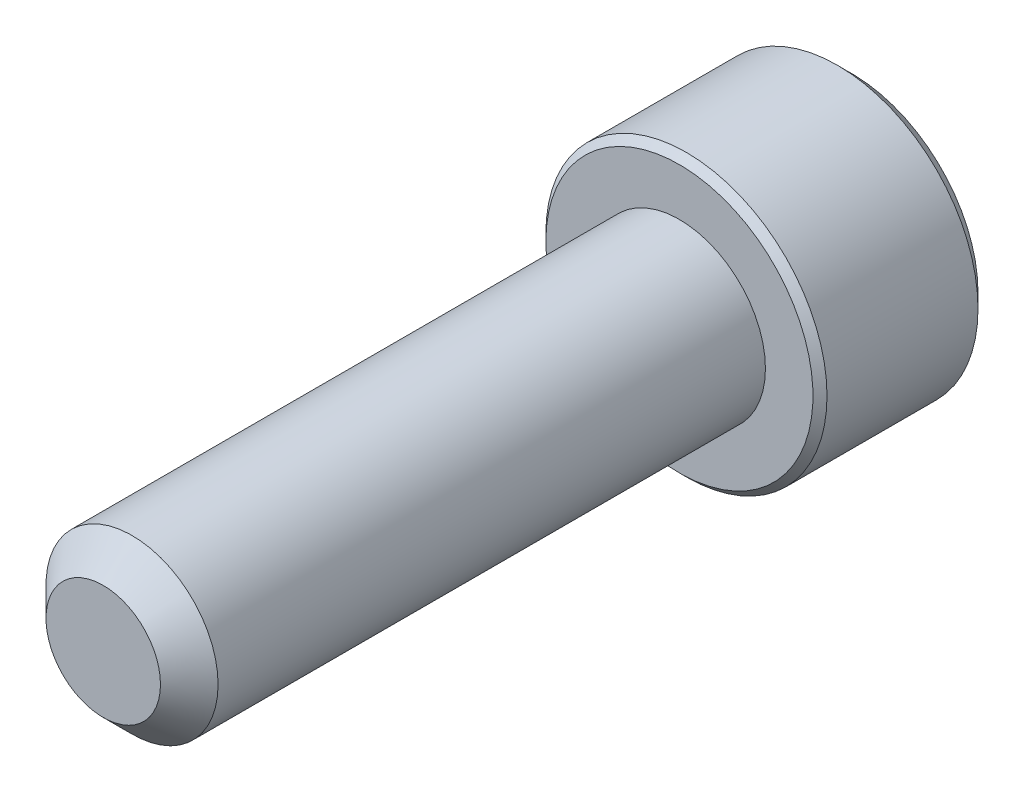
ISO-10303-21;
HEADER;
FILE_DESCRIPTION(('STEP AP214'),'2;1');
FILE_NAME('part.step','',(''),(''),'','','');
FILE_SCHEMA(('AUTOMOTIVE_DESIGN { 1 0 10303 214 1 1 1 1 }'));
ENDSEC;
DATA;
#1=APPLICATION_CONTEXT('core data for automotive mechanical design processes');
#2=APPLICATION_PROTOCOL_DEFINITION('international standard','automotive_design',2000,#1);
#3=PRODUCT_CONTEXT('',#1,'mechanical');
#4=PRODUCT('Part','Part','',(#3));
#5=PRODUCT_RELATED_PRODUCT_CATEGORY('part','',(#4));
#6=PRODUCT_DEFINITION_FORMATION('','',#4);
#7=PRODUCT_DEFINITION_CONTEXT('part definition',#1,'design');
#8=PRODUCT_DEFINITION('design','',#6,#7);
#9=PRODUCT_DEFINITION_SHAPE('','',#8);
#10=(LENGTH_UNIT() NAMED_UNIT(*) SI_UNIT(.MILLI.,.METRE.));
#11=(NAMED_UNIT(*) PLANE_ANGLE_UNIT() SI_UNIT($,.RADIAN.));
#12=(NAMED_UNIT(*) SI_UNIT($,.STERADIAN.) SOLID_ANGLE_UNIT());
#13=UNCERTAINTY_MEASURE_WITH_UNIT(LENGTH_MEASURE(1.E-05),#10,'distance_accuracy_value','');
#14=(GEOMETRIC_REPRESENTATION_CONTEXT(3) GLOBAL_UNCERTAINTY_ASSIGNED_CONTEXT((#13)) GLOBAL_UNIT_ASSIGNED_CONTEXT((#10,
#11,#12)) REPRESENTATION_CONTEXT('',''));
#15=CARTESIAN_POINT('',(0.,0.,0.));
#16=DIRECTION('',(0.,0.,1.));
#17=DIRECTION('',(1.,0.,0.));
#18=AXIS2_PLACEMENT_3D('',#15,#16,#17);
#19=CARTESIAN_POINT('',(0.,0.,-9.525));
#20=DIRECTION('',(0.,0.,1.));
#21=DIRECTION('',(1.,0.,0.));
#22=AXIS2_PLACEMENT_3D('',#19,#20,#21);
#23=CYLINDRICAL_SURFACE('',#22,1.4224);
#24=CARTESIAN_POINT('',(0.,0.,-0.476249999999998));
#25=DIRECTION('',(0.,0.,1.));
#26=DIRECTION('',(1.,0.,0.));
#27=AXIS2_PLACEMENT_3D('',#24,#25,#26);
#28=CIRCLE('',#27,1.4224);
#29=CARTESIAN_POINT('',(1.4224,0.,-0.476249999999998));
#30=VERTEX_POINT('',#29);
#31=EDGE_CURVE('E109',#30,#30,#28,.F.);
#32=CARTESIAN_POINT('',(0.,0.,-9.525));
#33=DIRECTION('',(0.,0.,-1.));
#34=DIRECTION('',(-1.,0.,0.));
#35=AXIS2_PLACEMENT_3D('',#32,#33,#34);
#36=CIRCLE('',#35,1.4224);
#37=CARTESIAN_POINT('',(1.4224,0.,-9.525));
#38=VERTEX_POINT('',#37);
#39=EDGE_CURVE('E209',#38,#38,#36,.F.);
#40=CARTESIAN_POINT('',(1.4224,0.,-0.476249999999998));
#41=CARTESIAN_POINT('',(1.4224,0.,-0.570507812499997));
#42=CARTESIAN_POINT('',(1.4224,0.,-0.664765624999997));
#43=CARTESIAN_POINT('',(1.4224,0.,-0.853281249999997));
#44=CARTESIAN_POINT('',(1.4224,0.,-0.947539062499997));
#45=CARTESIAN_POINT('',(1.4224,0.,-1.1360546875));
#46=CARTESIAN_POINT('',(1.4224,0.,-1.2303125));
#47=CARTESIAN_POINT('',(1.4224,0.,-1.418828125));
#48=CARTESIAN_POINT('',(1.4224,0.,-1.5130859375));
#49=CARTESIAN_POINT('',(1.4224,0.,-1.7016015625));
#50=CARTESIAN_POINT('',(1.4224,0.,-1.795859375));
#51=CARTESIAN_POINT('',(1.4224,0.,-1.984375));
#52=CARTESIAN_POINT('',(1.4224,0.,-2.0786328125));
#53=CARTESIAN_POINT('',(1.4224,0.,-2.2671484375));
#54=CARTESIAN_POINT('',(1.4224,0.,-2.36140625));
#55=CARTESIAN_POINT('',(1.4224,0.,-2.549921875));
#56=CARTESIAN_POINT('',(1.4224,0.,-2.6441796875));
#57=CARTESIAN_POINT('',(1.4224,0.,-2.8326953125));
#58=CARTESIAN_POINT('',(1.4224,0.,-2.926953125));
#59=CARTESIAN_POINT('',(1.4224,0.,-3.11546875));
#60=CARTESIAN_POINT('',(1.4224,0.,-3.2097265625));
#61=CARTESIAN_POINT('',(1.4224,0.,-3.3982421875));
#62=CARTESIAN_POINT('',(1.4224,0.,-3.4925));
#63=CARTESIAN_POINT('',(1.4224,0.,-3.681015625));
#64=CARTESIAN_POINT('',(1.4224,0.,-3.7752734375));
#65=CARTESIAN_POINT('',(1.4224,0.,-3.9637890625));
#66=CARTESIAN_POINT('',(1.4224,0.,-4.058046875));
#67=CARTESIAN_POINT('',(1.4224,0.,-4.2465625));
#68=CARTESIAN_POINT('',(1.4224,0.,-4.3408203125));
#69=CARTESIAN_POINT('',(1.4224,0.,-4.5293359375));
#70=CARTESIAN_POINT('',(1.4224,0.,-4.62359375));
#71=CARTESIAN_POINT('',(1.4224,0.,-4.812109375));
#72=CARTESIAN_POINT('',(1.4224,0.,-4.9063671875));
#73=CARTESIAN_POINT('',(1.4224,0.,-5.0948828125));
#74=CARTESIAN_POINT('',(1.4224,0.,-5.189140625));
#75=CARTESIAN_POINT('',(1.4224,0.,-5.37765625));
#76=CARTESIAN_POINT('',(1.4224,0.,-5.4719140625));
#77=CARTESIAN_POINT('',(1.4224,0.,-5.6604296875));
#78=CARTESIAN_POINT('',(1.4224,0.,-5.7546875));
#79=CARTESIAN_POINT('',(1.4224,0.,-5.943203125));
#80=CARTESIAN_POINT('',(1.4224,0.,-6.0374609375));
#81=CARTESIAN_POINT('',(1.4224,0.,-6.2259765625));
#82=CARTESIAN_POINT('',(1.4224,0.,-6.320234375));
#83=CARTESIAN_POINT('',(1.4224,0.,-6.50875));
#84=CARTESIAN_POINT('',(1.4224,0.,-6.6030078125));
#85=CARTESIAN_POINT('',(1.4224,0.,-6.7915234375));
#86=CARTESIAN_POINT('',(1.4224,0.,-6.88578125));
#87=CARTESIAN_POINT('',(1.4224,0.,-7.074296875));
#88=CARTESIAN_POINT('',(1.4224,0.,-7.1685546875));
#89=CARTESIAN_POINT('',(1.4224,0.,-7.3570703125));
#90=CARTESIAN_POINT('',(1.4224,0.,-7.451328125));
#91=CARTESIAN_POINT('',(1.4224,0.,-7.63984375));
#92=CARTESIAN_POINT('',(1.4224,0.,-7.7341015625));
#93=CARTESIAN_POINT('',(1.4224,0.,-7.9226171875));
#94=CARTESIAN_POINT('',(1.4224,0.,-8.016875));
#95=CARTESIAN_POINT('',(1.4224,0.,-8.205390625));
#96=CARTESIAN_POINT('',(1.4224,0.,-8.2996484375));
#97=CARTESIAN_POINT('',(1.4224,0.,-8.4881640625));
#98=CARTESIAN_POINT('',(1.4224,0.,-8.582421875));
#99=CARTESIAN_POINT('',(1.4224,0.,-8.7709375));
#100=CARTESIAN_POINT('',(1.4224,0.,-8.8651953125));
#101=CARTESIAN_POINT('',(1.4224,0.,-9.0537109375));
#102=CARTESIAN_POINT('',(1.4224,0.,-9.14796875));
#103=CARTESIAN_POINT('',(1.4224,0.,-9.336484375));
#104=CARTESIAN_POINT('',(1.4224,0.,-9.4307421875));
#105=CARTESIAN_POINT('',(1.4224,0.,-9.525));
#106=B_SPLINE_CURVE_WITH_KNOTS('',3,(#40,#41,#42,#43,#44,#45,#46,#47,#48,#49,#50,#51,#52,#53,
#54,#55,#56,#57,#58,#59,#60,#61,#62,#63,#64,#65,#66,#67,#68,#69,#70,#71,#72,#73,#74,#75,#76,#77,
#78,#79,#80,#81,#82,#83,#84,#85,#86,#87,#88,#89,#90,#91,#92,#93,#94,#95,#96,#97,#98,#99,#100,
#101,#102,#103,#104,#105),.UNSPECIFIED.,.F.,.F.,(4,2,2,2,2,2,2,2,2,2,2,2,2,2,2,2,2,2,2,2,2,2,2,
2,2,2,2,2,2,2,2,2,4),(0.,0.2827734375,0.565546875,0.848320312500001,1.13109375,1.4138671875,
1.696640625,1.9794140625,2.2621875,2.5449609375,2.827734375,3.1105078125,3.39328125,
3.6760546875,3.958828125,4.2416015625,4.524375,4.8071484375,5.089921875,5.3726953125,5.65546875,
5.9382421875,6.221015625,6.5037890625,6.7865625,7.0693359375,7.352109375,7.6348828125,
7.91765625,8.2004296875,8.483203125,8.7659765625,9.04875),.UNSPECIFIED.);
#107=EDGE_CURVE('BSEAM35',#30,#38,#106,.T.);
#108=ORIENTED_EDGE('',*,*,#31,.T.);
#109=ORIENTED_EDGE('',*,*,#39,.T.);
#110=ORIENTED_EDGE('',*,*,#107,.T.);
#111=ORIENTED_EDGE('',*,*,#107,.F.);
#112=EDGE_LOOP('',(#108,#110,#109,#111));
#113=FACE_BOUND('',#112,.T.);
#114=ADVANCED_FACE('F35',(#113),#23,.T.);
#115=CARTESIAN_POINT('',(0.,0.,0.));
#116=DIRECTION('',(0.,0.,1.));
#117=DIRECTION('',(1.,0.,0.));
#118=AXIS2_PLACEMENT_3D('',#115,#116,#117);
#119=PLANE('',#118);
#120=CARTESIAN_POINT('',(0.,0.,0.));
#121=DIRECTION('',(0.,0.,1.));
#122=DIRECTION('',(1.,0.,0.));
#123=AXIS2_PLACEMENT_3D('',#120,#121,#122);
#124=CIRCLE('',#123,0.946150000000001);
#125=CARTESIAN_POINT('',(0.946150000000001,0.,0.));
#126=VERTEX_POINT('',#125);
#127=EDGE_CURVE('E208',#126,#126,#124,.T.);
#128=ORIENTED_EDGE('',*,*,#127,.T.);
#129=EDGE_LOOP('',(#128));
#130=FACE_BOUND('',#129,.T.);
#131=ADVANCED_FACE('F186',(#130),#119,.T.);
#132=CARTESIAN_POINT('',(0.,0.,0.));
#133=DIRECTION('',(0.,0.,-1.));
#134=DIRECTION('',(-1.,0.,0.));
#135=AXIS2_PLACEMENT_3D('',#132,#133,#134);
#136=CONICAL_SURFACE('',#135,0.946150000000001,0.78539816339745);
#137=ORIENTED_EDGE('',*,*,#31,.F.);
#138=EDGE_LOOP('',(#137));
#139=FACE_BOUND('',#138,.T.);
#140=ORIENTED_EDGE('',*,*,#127,.F.);
#141=EDGE_LOOP('',(#140));
#142=FACE_BOUND('',#141,.T.);
#143=ADVANCED_FACE('F192',(#139,#142),#136,.T.);
#144=CARTESIAN_POINT('',(0.,0.,-12.3698));
#145=DIRECTION('',(0.,0.,1.));
#146=DIRECTION('',(1.,0.,0.));
#147=AXIS2_PLACEMENT_3D('',#144,#145,#146);
#148=CYLINDRICAL_SURFACE('',#147,2.3241);
#149=CARTESIAN_POINT('',(0.,0.,-9.641205));
#150=DIRECTION('',(0.,0.,-1.));
#151=DIRECTION('',(-1.,0.,0.));
#152=AXIS2_PLACEMENT_3D('',#149,#150,#151);
#153=CIRCLE('',#152,2.3241);
#154=CARTESIAN_POINT('',(2.3241,0.,-9.641205));
#155=VERTEX_POINT('',#154);
#156=EDGE_CURVE('E43',#155,#155,#153,.T.);
#157=CARTESIAN_POINT('',(0.,0.,-12.13739));
#158=DIRECTION('',(0.,0.,-1.));
#159=DIRECTION('',(-1.,0.,0.));
#160=AXIS2_PLACEMENT_3D('',#157,#158,#159);
#161=CIRCLE('',#160,2.3241);
#162=CARTESIAN_POINT('',(2.3241,0.,-12.13739));
#163=VERTEX_POINT('',#162);
#164=EDGE_CURVE('E169',#163,#163,#161,.F.);
#165=CARTESIAN_POINT('',(2.3241,0.,-9.641205));
#166=CARTESIAN_POINT('',(2.3241,0.,-9.66720692708333));
#167=CARTESIAN_POINT('',(2.3241,0.,-9.69320885416667));
#168=CARTESIAN_POINT('',(2.3241,0.,-9.74521270833333));
#169=CARTESIAN_POINT('',(2.3241,0.,-9.77121463541667));
#170=CARTESIAN_POINT('',(2.3241,0.,-9.82321848958333));
#171=CARTESIAN_POINT('',(2.3241,0.,-9.84922041666666));
#172=CARTESIAN_POINT('',(2.3241,0.,-9.90122427083333));
#173=CARTESIAN_POINT('',(2.3241,0.,-9.92722619791667));
#174=CARTESIAN_POINT('',(2.3241,0.,-9.97923005208333));
#175=CARTESIAN_POINT('',(2.3241,0.,-10.0052319791667));
#176=CARTESIAN_POINT('',(2.3241,0.,-10.0572358333333));
#177=CARTESIAN_POINT('',(2.3241,0.,-10.0832377604167));
#178=CARTESIAN_POINT('',(2.3241,0.,-10.1352416145833));
#179=CARTESIAN_POINT('',(2.3241,0.,-10.1612435416667));
#180=CARTESIAN_POINT('',(2.3241,0.,-10.2132473958333));
#181=CARTESIAN_POINT('',(2.3241,0.,-10.2392493229167));
#182=CARTESIAN_POINT('',(2.3241,0.,-10.2912531770833));
#183=CARTESIAN_POINT('',(2.3241,0.,-10.3172551041667));
#184=CARTESIAN_POINT('',(2.3241,0.,-10.3692589583333));
#185=CARTESIAN_POINT('',(2.3241,0.,-10.3952608854167));
#186=CARTESIAN_POINT('',(2.3241,0.,-10.4472647395833));
#187=CARTESIAN_POINT('',(2.3241,0.,-10.4732666666667));
#188=CARTESIAN_POINT('',(2.3241,0.,-10.5252705208333));
#189=CARTESIAN_POINT('',(2.3241,0.,-10.5512724479167));
#190=CARTESIAN_POINT('',(2.3241,0.,-10.6032763020833));
#191=CARTESIAN_POINT('',(2.3241,0.,-10.6292782291667));
#192=CARTESIAN_POINT('',(2.3241,0.,-10.6812820833333));
#193=CARTESIAN_POINT('',(2.3241,0.,-10.7072840104167));
#194=CARTESIAN_POINT('',(2.3241,0.,-10.7592878645833));
#195=CARTESIAN_POINT('',(2.3241,0.,-10.7852897916667));
#196=CARTESIAN_POINT('',(2.3241,0.,-10.8372936458333));
#197=CARTESIAN_POINT('',(2.3241,0.,-10.8632955729167));
#198=CARTESIAN_POINT('',(2.3241,0.,-10.9152994270833));
#199=CARTESIAN_POINT('',(2.3241,0.,-10.9413013541667));
#200=CARTESIAN_POINT('',(2.3241,0.,-10.9933052083333));
#201=CARTESIAN_POINT('',(2.3241,0.,-11.0193071354167));
#202=CARTESIAN_POINT('',(2.3241,0.,-11.0713109895833));
#203=CARTESIAN_POINT('',(2.3241,0.,-11.0973129166667));
#204=CARTESIAN_POINT('',(2.3241,0.,-11.1493167708333));
#205=CARTESIAN_POINT('',(2.3241,0.,-11.1753186979167));
#206=CARTESIAN_POINT('',(2.3241,0.,-11.2273225520833));
#207=CARTESIAN_POINT('',(2.3241,0.,-11.2533244791667));
#208=CARTESIAN_POINT('',(2.3241,0.,-11.3053283333333));
#209=CARTESIAN_POINT('',(2.3241,0.,-11.3313302604167));
#210=CARTESIAN_POINT('',(2.3241,0.,-11.3833341145833));
#211=CARTESIAN_POINT('',(2.3241,0.,-11.4093360416667));
#212=CARTESIAN_POINT('',(2.3241,0.,-11.4613398958333));
#213=CARTESIAN_POINT('',(2.3241,0.,-11.4873418229167));
#214=CARTESIAN_POINT('',(2.3241,0.,-11.5393456770833));
#215=CARTESIAN_POINT('',(2.3241,0.,-11.5653476041667));
#216=CARTESIAN_POINT('',(2.3241,0.,-11.6173514583333));
#217=CARTESIAN_POINT('',(2.3241,0.,-11.6433533854167));
#218=CARTESIAN_POINT('',(2.3241,0.,-11.6953572395833));
#219=CARTESIAN_POINT('',(2.3241,0.,-11.7213591666667));
#220=CARTESIAN_POINT('',(2.3241,0.,-11.7733630208333));
#221=CARTESIAN_POINT('',(2.3241,0.,-11.7993649479167));
#222=CARTESIAN_POINT('',(2.3241,0.,-11.8513688020833));
#223=CARTESIAN_POINT('',(2.3241,0.,-11.8773707291667));
#224=CARTESIAN_POINT('',(2.3241,0.,-11.9293745833333));
#225=CARTESIAN_POINT('',(2.3241,0.,-11.9553765104167));
#226=CARTESIAN_POINT('',(2.3241,0.,-12.0073803645833));
#227=CARTESIAN_POINT('',(2.3241,0.,-12.0333822916667));
#228=CARTESIAN_POINT('',(2.3241,0.,-12.0853861458333));
#229=CARTESIAN_POINT('',(2.3241,0.,-12.1113880729167));
#230=CARTESIAN_POINT('',(2.3241,0.,-12.13739));
#231=B_SPLINE_CURVE_WITH_KNOTS('',3,(#165,#166,#167,#168,#169,#170,#171,#172,#173,#174,#175,
#176,#177,#178,#179,#180,#181,#182,#183,#184,#185,#186,#187,#188,#189,#190,#191,#192,#193,#194,
#195,#196,#197,#198,#199,#200,#201,#202,#203,#204,#205,#206,#207,#208,#209,#210,#211,#212,#213,
#214,#215,#216,#217,#218,#219,#220,#221,#222,#223,#224,#225,#226,#227,#228,#229,#230),
.UNSPECIFIED.,.F.,.F.,(4,2,2,2,2,2,2,2,2,2,2,2,2,2,2,2,2,2,2,2,2,2,2,2,2,2,2,2,2,2,2,2,4),(0.,
0.0780057812499995,0.156011562499999,0.234017343749998,0.312023124999998,0.390028906249999,
0.468034687499999,0.546040468749998,0.624046249999998,0.702052031249997,0.780057812499999,
0.858063593749998,0.936069374999998,1.01407515625,1.0920809375,1.17008671875,1.2480925,
1.32609828125,1.4041040625,1.48210984375,1.560115625,1.63812140625,1.7161271875,1.79413296875,
1.87213875,1.95014453125,2.0281503125,2.10615609375,2.184161875,2.26216765625,2.3401734375,
2.41817921874999,2.49618499999999),.UNSPECIFIED.);
#232=EDGE_CURVE('BSEAM174',#155,#163,#231,.T.);
#233=ORIENTED_EDGE('',*,*,#156,.T.);
#234=ORIENTED_EDGE('',*,*,#164,.T.);
#235=ORIENTED_EDGE('',*,*,#232,.T.);
#236=ORIENTED_EDGE('',*,*,#232,.F.);
#237=EDGE_LOOP('',(#233,#235,#234,#236));
#238=FACE_BOUND('',#237,.T.);
#239=ADVANCED_FACE('F174',(#238),#148,.T.);
#240=CARTESIAN_POINT('',(0.,0.,-12.3698));
#241=DIRECTION('',(0.,0.,-1.));
#242=DIRECTION('',(-1.,0.,0.));
#243=AXIS2_PLACEMENT_3D('',#240,#241,#242);
#244=PLANE('',#243);
#245=CARTESIAN_POINT('',(0.,0.,-12.3698));
#246=DIRECTION('',(0.,0.,-1.));
#247=DIRECTION('',(-1.,0.,0.));
#248=AXIS2_PLACEMENT_3D('',#245,#246,#247);
#249=CIRCLE('',#248,2.09169);
#250=CARTESIAN_POINT('',(2.09169,0.,-12.3698));
#251=VERTEX_POINT('',#250);
#252=EDGE_CURVE('E108',#251,#251,#249,.T.);
#253=ORIENTED_EDGE('',*,*,#252,.T.);
#254=EDGE_LOOP('',(#253));
#255=FACE_BOUND('',#254,.T.);
#256=CARTESIAN_POINT('',(0.,0.,-12.3698));
#257=DIRECTION('',(0.,0.,-1.));
#258=DIRECTION('',(-1.,0.,0.));
#259=AXIS2_PLACEMENT_3D('',#256,#257,#258);
#260=CIRCLE('',#259,1.3748153285078);
#261=CARTESIAN_POINT('',(-1.190625,0.687407664253897,-12.3698));
#262=VERTEX_POINT('',#261);
#263=CARTESIAN_POINT('',(0.,1.3748153285078,-12.3698));
#264=VERTEX_POINT('',#263);
#265=EDGE_CURVE('E89',#262,#264,#260,.T.);
#266=ORIENTED_EDGE('',*,*,#265,.F.);
#267=CARTESIAN_POINT('',(-1.190625,-0.687407664253898,-12.3698));
#268=VERTEX_POINT('',#267);
#269=EDGE_CURVE('E49',#268,#262,#260,.T.);
#270=ORIENTED_EDGE('',*,*,#269,.F.);
#271=CARTESIAN_POINT('',(0.,-1.3748153285078,-12.3698));
#272=VERTEX_POINT('',#271);
#273=EDGE_CURVE('E265',#272,#268,#260,.T.);
#274=ORIENTED_EDGE('',*,*,#273,.F.);
#275=CARTESIAN_POINT('',(1.190625,-0.687407664253898,-12.3698));
#276=VERTEX_POINT('',#275);
#277=EDGE_CURVE('E56',#276,#272,#260,.T.);
#278=ORIENTED_EDGE('',*,*,#277,.F.);
#279=CARTESIAN_POINT('',(1.190625,0.687407664253899,-12.3698));
#280=VERTEX_POINT('',#279);
#281=EDGE_CURVE('E130',#280,#276,#260,.T.);
#282=ORIENTED_EDGE('',*,*,#281,.F.);
#283=EDGE_CURVE('E98',#264,#280,#260,.T.);
#284=ORIENTED_EDGE('',*,*,#283,.F.);
#285=EDGE_LOOP('',(#266,#270,#274,#278,#282,#284));
#286=FACE_BOUND('',#285,.T.);
#287=ADVANCED_FACE('F129',(#255,#286),#244,.T.);
#288=CARTESIAN_POINT('',(0.,0.,-9.525));
#289=DIRECTION('',(0.,0.,-1.));
#290=DIRECTION('',(-1.,0.,0.));
#291=AXIS2_PLACEMENT_3D('',#288,#289,#290);
#292=PLANE('',#291);
#293=CARTESIAN_POINT('',(0.,0.,-9.525));
#294=DIRECTION('',(0.,0.,-1.));
#295=DIRECTION('',(-1.,0.,0.));
#296=AXIS2_PLACEMENT_3D('',#293,#294,#295);
#297=CIRCLE('',#296,2.207895);
#298=CARTESIAN_POINT('',(-2.207895,0.,-9.525));
#299=VERTEX_POINT('',#298);
#300=EDGE_CURVE('E11',#299,#299,#297,.F.);
#301=ORIENTED_EDGE('',*,*,#300,.T.);
#302=EDGE_LOOP('',(#301));
#303=FACE_BOUND('',#302,.T.);
#304=ORIENTED_EDGE('',*,*,#39,.F.);
#305=EDGE_LOOP('',(#304));
#306=FACE_BOUND('',#305,.T.);
#307=ADVANCED_FACE('F277',(#303,#306),#292,.F.);
#308=CARTESIAN_POINT('',(0.,0.,-12.3698));
#309=DIRECTION('',(0.,0.,-1.));
#310=DIRECTION('',(-1.,0.,0.));
#311=AXIS2_PLACEMENT_3D('',#308,#309,#310);
#312=CONICAL_SURFACE('',#311,1.3748153285078,0.78539816339745);
#313=ORIENTED_EDGE('',*,*,#283,.T.);
#314=CARTESIAN_POINT('',(-0.00020000000000008,1.37493079856163,-12.3699154846));
#315=CARTESIAN_POINT('',(0.0407344195898564,1.35129730039231,-12.3462987642143));
#316=CARTESIAN_POINT('',(0.082353388301974,1.32726857760297,-12.3240687817231));
#317=CARTESIAN_POINT('',(0.167219443673632,1.27827113768908,-12.2833656626274));
#318=CARTESIAN_POINT('',(0.21047460729096,1.25329775733078,-12.2649151826476));
#319=CARTESIAN_POINT('',(0.297696647457423,1.2029400889614,-12.2333088380043));
#320=CARTESIAN_POINT('',(0.341641294957924,1.17756863489755,-12.2200735042433));
#321=CARTESIAN_POINT('',(0.430498374163693,1.12626697629869,-12.1996814515754));
#322=CARTESIAN_POINT('',(0.475408088834754,1.10033834044413,-12.192509502896));
#323=CARTESIAN_POINT('',(0.552804127656977,1.0556537165959,-12.1860385386489));
#324=CARTESIAN_POINT('',(0.585190412515645,1.0369554863147,-12.1850803201468));
#325=CARTESIAN_POINT('',(0.649906073317768,0.99959188212981,-12.1866926490721));
#326=CARTESIAN_POINT('',(0.682235435127271,0.980926516386365,-12.1892639751796));
#327=CARTESIAN_POINT('',(0.746582156071483,0.943775919727755,-12.1977867539936));
#328=CARTESIAN_POINT('',(0.778599196336766,0.925290872911938,-12.2037413547526));
#329=CARTESIAN_POINT('',(0.842098763396455,0.888629380776602,-12.2187099640712));
#330=CARTESIAN_POINT('',(0.873581054644162,0.870453071450032,-12.2277252859121));
#331=CARTESIAN_POINT('',(0.954214838572126,0.823899134593445,-12.254482295838));
#332=CARTESIAN_POINT('',(1.00285783526766,0.795815087357089,-12.274236814436));
#333=CARTESIAN_POINT('',(1.09823941635212,0.740746505842243,-12.3187367689577));
#334=CARTESIAN_POINT('',(1.14498361758716,0.713758728676141,-12.3434659647162));
#335=CARTESIAN_POINT('',(1.190825,0.68729219420006,-12.3699154846));
#336=B_SPLINE_CURVE_WITH_KNOTS('',3,(#314,#315,#316,#317,#318,#319,#320,#321,#322,#323,#324,
#325,#326,#327,#328,#329,#330,#331,#332,#333,#334,#335),.UNSPECIFIED.,.F.,.F.,(4,2,2,2,2,2,2,2,
2,2,4),(0.,0.158625672934121,0.318176079843271,0.475191357500655,0.631811068630747,
0.743878551794716,0.855970763007027,0.968167444423239,1.08041232768376,1.25873351645467,
1.43648174479847),.UNSPECIFIED.);
#337=EDGE_CURVE('E103',#264,#280,#336,.T.);
#338=ORIENTED_EDGE('',*,*,#337,.F.);
#339=EDGE_LOOP('',(#313,#338));
#340=FACE_BOUND('',#339,.T.);
#341=ADVANCED_FACE('F104',(#340),#312,.F.);
#342=ORIENTED_EDGE('',*,*,#281,.T.);
#343=CARTESIAN_POINT('',(1.190625,-1.37097145294694,-12.8107904472899));
#344=CARTESIAN_POINT('',(1.190625,-1.3375892063789,-12.7855899888078));
#345=CARTESIAN_POINT('',(1.190625,-1.30402095496658,-12.7606366202375));
#346=CARTESIAN_POINT('',(1.190625,-1.23643692297761,-12.7113260871772));
#347=CARTESIAN_POINT('',(1.190625,-1.20242103219112,-12.6869690738994));
#348=CARTESIAN_POINT('',(1.190625,-1.09909081482554,-12.6145982089892));
#349=CARTESIAN_POINT('',(1.190625,-1.02900143506767,-12.5676726225956));
#350=CARTESIAN_POINT('',(1.190625,-0.88202673742423,-12.4755521033256));
#351=CARTESIAN_POINT('',(1.190625,-0.804981866019981,-12.4306088372421));
#352=CARTESIAN_POINT('',(1.190625,-0.647043893307965,-12.3483980245069));
#353=CARTESIAN_POINT('',(1.190625,-0.566164943702921,-12.3111046017321));
#354=CARTESIAN_POINT('',(1.190625,-0.444764933868856,-12.2654795555631));
#355=CARTESIAN_POINT('',(1.190625,-0.406041211486713,-12.2523848390215));
#356=CARTESIAN_POINT('',(1.190625,-0.327658904711933,-12.2293042758966));
#357=CARTESIAN_POINT('',(1.190625,-0.288000256118252,-12.219318643486));
#358=CARTESIAN_POINT('',(1.190625,-0.208647693212097,-12.2031412290653));
#359=CARTESIAN_POINT('',(1.190625,-0.168967240621962,-12.196884445849));
#360=CARTESIAN_POINT('',(1.190625,-0.0891819742965338,-12.1882868884185));
#361=CARTESIAN_POINT('',(1.190625,-0.0490772347013131,-12.1859454410499));
#362=CARTESIAN_POINT('',(1.190625,0.0297075773931757,-12.1853522440677));
#363=CARTESIAN_POINT('',(1.190625,0.0683866068288079,-12.1869553537961));
#364=CARTESIAN_POINT('',(1.190625,0.14541687663315,-12.1938430277445));
#365=CARTESIAN_POINT('',(1.190625,0.183768052740678,-12.1991282976685));
#366=CARTESIAN_POINT('',(1.190625,0.260508634904943,-12.2131814122329));
#367=CARTESIAN_POINT('',(1.190625,0.298887052039132,-12.2220083626058));
#368=CARTESIAN_POINT('',(1.190625,0.374805334250663,-12.2426757099806));
#369=CARTESIAN_POINT('',(1.190625,0.412345269207093,-12.2545158548359));
#370=CARTESIAN_POINT('',(1.190625,0.530535580908839,-12.2962473336672));
#371=CARTESIAN_POINT('',(1.190625,0.609503725744446,-12.3308913969143));
#372=CARTESIAN_POINT('',(1.190625,0.763730269113466,-12.4079182519749));
#373=CARTESIAN_POINT('',(1.190625,0.838974064674606,-12.4503288466687));
#374=CARTESIAN_POINT('',(1.190625,0.982775796189617,-12.537825645025));
#375=CARTESIAN_POINT('',(1.190625,1.05148016607044,-12.5826741620552));
#376=CARTESIAN_POINT('',(1.190625,1.15270222256253,-12.6520053299226));
#377=CARTESIAN_POINT('',(1.190625,1.18600604145834,-12.6753601763372));
#378=CARTESIAN_POINT('',(1.190625,1.25215860362231,-12.7226875690193));
#379=CARTESIAN_POINT('',(1.190625,1.28500746868278,-12.7466599448583));
#380=CARTESIAN_POINT('',(1.190625,1.31766689427973,-12.7708883667713));
#381=B_SPLINE_CURVE_WITH_KNOTS('',3,(#343,#344,#345,#346,#347,#348,#349,#350,#351,#352,#353,
#354,#355,#356,#357,#358,#359,#360,#361,#362,#363,#364,#365,#366,#367,#368,#369,#370,#371,#372,
#373,#374,#375,#376,#377,#378,#379,#380),.UNSPECIFIED.,.F.,.F.,(4,2,2,2,2,2,2,2,2,2,2,2,2,2,2,2,
2,2,4),(0.,0.12547564476333,0.250982782413966,0.503912518769173,0.771279184643223,
1.03772598255657,1.16025581644629,1.28279408906665,1.40312855503246,1.5234423300503,
1.63939577664877,1.75537145240477,1.87336894094838,1.99135655861152,2.24929724983449,
2.50818004711563,2.75419821472196,2.87622362118596,2.99821570388961),.UNSPECIFIED.);
#382=EDGE_CURVE('E97',#280,#276,#381,.F.);
#383=ORIENTED_EDGE('',*,*,#382,.F.);
#384=EDGE_LOOP('',(#342,#383));
#385=FACE_BOUND('',#384,.T.);
#386=ADVANCED_FACE('F271',(#385),#312,.F.);
#387=ORIENTED_EDGE('',*,*,#277,.T.);
#388=CARTESIAN_POINT('',(1.190825,-0.687292194200061,-12.3699154846));
#389=CARTESIAN_POINT('',(1.14989058041014,-0.710925692369386,-12.3462987642143));
#390=CARTESIAN_POINT('',(1.10827161169803,-0.734954415158721,-12.3240687817231));
#391=CARTESIAN_POINT('',(1.02340555632637,-0.78395185507261,-12.2833656626274));
#392=CARTESIAN_POINT('',(0.98015039270904,-0.808925235430916,-12.2649151826476));
#393=CARTESIAN_POINT('',(0.892928352542576,-0.859282903800292,-12.2333088380043));
#394=CARTESIAN_POINT('',(0.848983705042075,-0.884654357864149,-12.2200735042433));
#395=CARTESIAN_POINT('',(0.760126625836307,-0.935956016463003,-12.1996814515754));
#396=CARTESIAN_POINT('',(0.715216911165246,-0.96188465231757,-12.192509502896));
#397=CARTESIAN_POINT('',(0.637820872343022,-1.00656927616579,-12.1860385386489));
#398=CARTESIAN_POINT('',(0.605434587484354,-1.025267506447,-12.1850803201468));
#399=CARTESIAN_POINT('',(0.540718926682231,-1.06263111063189,-12.1866926490721));
#400=CARTESIAN_POINT('',(0.508389564872728,-1.08129647637533,-12.1892639751796));
#401=CARTESIAN_POINT('',(0.444042843928516,-1.11844707303394,-12.1977867539936));
#402=CARTESIAN_POINT('',(0.412025803663233,-1.13693211984976,-12.2037413547526));
#403=CARTESIAN_POINT('',(0.348526236603543,-1.17359361198509,-12.2187099640712));
#404=CARTESIAN_POINT('',(0.317043945355836,-1.19176992131166,-12.2277252859121));
#405=CARTESIAN_POINT('',(0.236410161427874,-1.23832385816825,-12.254482295838));
#406=CARTESIAN_POINT('',(0.187767164732342,-1.26640790540461,-12.274236814436));
#407=CARTESIAN_POINT('',(0.0923855836478811,-1.32147648691945,-12.3187367689577));
#408=CARTESIAN_POINT('',(0.0456413824128445,-1.34846426408555,-12.3434659647162));
#409=CARTESIAN_POINT('',(-0.000199999999999968,-1.37493079856163,-12.3699154846));
#410=B_SPLINE_CURVE_WITH_KNOTS('',3,(#388,#389,#390,#391,#392,#393,#394,#395,#396,#397,#398,
#399,#400,#401,#402,#403,#404,#405,#406,#407,#408,#409),.UNSPECIFIED.,.F.,.F.,(4,2,2,2,2,2,2,2,
2,2,4),(0.,0.15862567293412,0.318176079843271,0.475191357500655,0.631811068630748,
0.743878551794717,0.855970763007028,0.968167444423241,1.08041232768376,1.25873351645467,
1.43648174479847),.UNSPECIFIED.);
#411=EDGE_CURVE('E139',#276,#272,#410,.T.);
#412=ORIENTED_EDGE('',*,*,#411,.F.);
#413=EDGE_LOOP('',(#387,#412));
#414=FACE_BOUND('',#413,.T.);
#415=ADVANCED_FACE('F268',(#414),#312,.F.);
#416=ORIENTED_EDGE('',*,*,#273,.T.);
#417=CARTESIAN_POINT('',(0.000200000000000319,-1.37493079856163,-12.3699154846));
#418=CARTESIAN_POINT('',(-0.0407344195898558,-1.35129730039231,-12.3462987642143));
#419=CARTESIAN_POINT('',(-0.0823533883019732,-1.32726857760297,-12.3240687817231));
#420=CARTESIAN_POINT('',(-0.167219443673632,-1.27827113768909,-12.2833656626274));
#421=CARTESIAN_POINT('',(-0.21047460729096,-1.25329775733078,-12.2649151826476));
#422=CARTESIAN_POINT('',(-0.297696647457424,-1.2029400889614,-12.2333088380043));
#423=CARTESIAN_POINT('',(-0.341641294957925,-1.17756863489755,-12.2200735042433));
#424=CARTESIAN_POINT('',(-0.430498374163694,-1.12626697629869,-12.1996814515754));
#425=CARTESIAN_POINT('',(-0.475408088834755,-1.10033834044413,-12.192509502896));
#426=CARTESIAN_POINT('',(-0.552804127656979,-1.0556537165959,-12.1860385386489));
#427=CARTESIAN_POINT('',(-0.585190412515647,-1.0369554863147,-12.1850803201468));
#428=CARTESIAN_POINT('',(-0.64990607331777,-0.99959188212981,-12.1866926490721));
#429=CARTESIAN_POINT('',(-0.682235435127273,-0.980926516386364,-12.1892639751796));
#430=CARTESIAN_POINT('',(-0.746582156071485,-0.943775919727754,-12.1977867539936));
#431=CARTESIAN_POINT('',(-0.778599196336769,-0.925290872911937,-12.2037413547526));
#432=CARTESIAN_POINT('',(-0.842098763396458,-0.888629380776601,-12.2187099640712));
#433=CARTESIAN_POINT('',(-0.873581054644165,-0.870453071450031,-12.2277252859121));
#434=CARTESIAN_POINT('',(-0.954214838572127,-0.823899134593444,-12.254482295838));
#435=CARTESIAN_POINT('',(-1.00285783526766,-0.795815087357089,-12.274236814436));
#436=CARTESIAN_POINT('',(-1.09823941635212,-0.740746505842244,-12.3187367689577));
#437=CARTESIAN_POINT('',(-1.14498361758716,-0.713758728676141,-12.3434659647162));
#438=CARTESIAN_POINT('',(-1.190825,-0.68729219420006,-12.3699154846));
#439=B_SPLINE_CURVE_WITH_KNOTS('',3,(#417,#418,#419,#420,#421,#422,#423,#424,#425,#426,#427,
#428,#429,#430,#431,#432,#433,#434,#435,#436,#437,#438),.UNSPECIFIED.,.F.,.F.,(4,2,2,2,2,2,2,2,
2,2,4),(0.,0.15862567293412,0.318176079843271,0.475191357500656,0.631811068630749,
0.743878551794719,0.85597076300703,0.968167444423243,1.08041232768377,1.25873351645467,
1.43648174479847),.UNSPECIFIED.);
#440=EDGE_CURVE('E243',#272,#268,#439,.T.);
#441=ORIENTED_EDGE('',*,*,#440,.F.);
#442=EDGE_LOOP('',(#416,#441));
#443=FACE_BOUND('',#442,.T.);
#444=ADVANCED_FACE('F267',(#443),#312,.F.);
#445=ORIENTED_EDGE('',*,*,#269,.T.);
#446=CARTESIAN_POINT('',(-1.190625,-1.37097145294693,-12.8107904472899));
#447=CARTESIAN_POINT('',(-1.190625,-1.3375892063789,-12.7855899888078));
#448=CARTESIAN_POINT('',(-1.190625,-1.30402095496658,-12.7606366202375));
#449=CARTESIAN_POINT('',(-1.190625,-1.23643692297761,-12.7113260871772));
#450=CARTESIAN_POINT('',(-1.190625,-1.20242103219112,-12.6869690738994));
#451=CARTESIAN_POINT('',(-1.190625,-1.09909081482554,-12.6145982089892));
#452=CARTESIAN_POINT('',(-1.190625,-1.02900143506767,-12.5676726225956));
#453=CARTESIAN_POINT('',(-1.190625,-0.882026737424228,-12.4755521033256));
#454=CARTESIAN_POINT('',(-1.190625,-0.80498186601998,-12.4306088372421));
#455=CARTESIAN_POINT('',(-1.190625,-0.647043893307964,-12.3483980245069));
#456=CARTESIAN_POINT('',(-1.190625,-0.56616494370292,-12.3111046017321));
#457=CARTESIAN_POINT('',(-1.190625,-0.444764933868855,-12.2654795555631));
#458=CARTESIAN_POINT('',(-1.190625,-0.406041211486712,-12.2523848390215));
#459=CARTESIAN_POINT('',(-1.190625,-0.327658904711932,-12.2293042758966));
#460=CARTESIAN_POINT('',(-1.190625,-0.288000256118251,-12.219318643486));
#461=CARTESIAN_POINT('',(-1.190625,-0.208647693212096,-12.2031412290653));
#462=CARTESIAN_POINT('',(-1.190625,-0.168967240621961,-12.196884445849));
#463=CARTESIAN_POINT('',(-1.190625,-0.0891819742965327,-12.1882868884185));
#464=CARTESIAN_POINT('',(-1.190625,-0.0490772347013117,-12.1859454410499));
#465=CARTESIAN_POINT('',(-1.190625,0.0297075773931773,-12.1853522440677));
#466=CARTESIAN_POINT('',(-1.190625,0.0683866068288095,-12.1869553537961));
#467=CARTESIAN_POINT('',(-1.190625,0.145416876633151,-12.1938430277445));
#468=CARTESIAN_POINT('',(-1.190625,0.183768052740679,-12.1991282976685));
#469=CARTESIAN_POINT('',(-1.190625,0.260508634904945,-12.2131814122329));
#470=CARTESIAN_POINT('',(-1.190625,0.298887052039133,-12.2220083626058));
#471=CARTESIAN_POINT('',(-1.190625,0.374805334250664,-12.2426757099806));
#472=CARTESIAN_POINT('',(-1.190625,0.412345269207095,-12.2545158548359));
#473=CARTESIAN_POINT('',(-1.190625,0.53053558090884,-12.2962473336672));
#474=CARTESIAN_POINT('',(-1.190625,0.609503725744448,-12.3308913969143));
#475=CARTESIAN_POINT('',(-1.190625,0.763730269113467,-12.4079182519749));
#476=CARTESIAN_POINT('',(-1.190625,0.838974064674607,-12.4503288466687));
#477=CARTESIAN_POINT('',(-1.190625,0.982775796189619,-12.537825645025));
#478=CARTESIAN_POINT('',(-1.190625,1.05148016607044,-12.5826741620552));
#479=CARTESIAN_POINT('',(-1.190625,1.15270222256253,-12.6520053299226));
#480=CARTESIAN_POINT('',(-1.190625,1.18600604145834,-12.6753601763372));
#481=CARTESIAN_POINT('',(-1.190625,1.25215860362232,-12.7226875690193));
#482=CARTESIAN_POINT('',(-1.190625,1.28500746868279,-12.7466599448583));
#483=CARTESIAN_POINT('',(-1.190625,1.31766689427973,-12.7708883667713));
#484=B_SPLINE_CURVE_WITH_KNOTS('',3,(#446,#447,#448,#449,#450,#451,#452,#453,#454,#455,#456,
#457,#458,#459,#460,#461,#462,#463,#464,#465,#466,#467,#468,#469,#470,#471,#472,#473,#474,#475,
#476,#477,#478,#479,#480,#481,#482,#483),.UNSPECIFIED.,.F.,.F.,(4,2,2,2,2,2,2,2,2,2,2,2,2,2,2,2,
2,2,4),(0.,0.12547564476333,0.250982782413968,0.503912518769174,0.771279184643224,
1.03772598255657,1.16025581644629,1.28279408906665,1.40312855503246,1.5234423300503,
1.63939577664877,1.75537145240478,1.87336894094838,1.99135655861152,2.24929724983449,
2.50818004711563,2.75419821472196,2.87622362118597,2.99821570388961),.UNSPECIFIED.);
#485=EDGE_CURVE('E119',#268,#262,#484,.T.);
#486=ORIENTED_EDGE('',*,*,#485,.F.);
#487=EDGE_LOOP('',(#445,#486));
#488=FACE_BOUND('',#487,.T.);
#489=ADVANCED_FACE('F284',(#488),#312,.F.);
#490=ORIENTED_EDGE('',*,*,#265,.T.);
#491=CARTESIAN_POINT('',(-1.190825,0.68729219420006,-12.3699154846));
#492=CARTESIAN_POINT('',(-1.14989058041014,0.710925692369385,-12.3462987642143));
#493=CARTESIAN_POINT('',(-1.10827161169803,0.734954415158721,-12.3240687817231));
#494=CARTESIAN_POINT('',(-1.02340555632637,0.783951855072609,-12.2833656626274));
#495=CARTESIAN_POINT('',(-0.980150392709039,0.808925235430915,-12.2649151826476));
#496=CARTESIAN_POINT('',(-0.892928352542576,0.859282903800291,-12.2333088380043));
#497=CARTESIAN_POINT('',(-0.848983705042075,0.884654357864149,-12.2200735042433));
#498=CARTESIAN_POINT('',(-0.760126625836306,0.935956016463004,-12.1996814515754));
#499=CARTESIAN_POINT('',(-0.715216911165244,0.96188465231757,-12.192509502896));
#500=CARTESIAN_POINT('',(-0.637820872343021,1.00656927616579,-12.1860385386489));
#501=CARTESIAN_POINT('',(-0.605434587484352,1.025267506447,-12.1850803201468));
#502=CARTESIAN_POINT('',(-0.540718926682229,1.06263111063189,-12.1866926490721));
#503=CARTESIAN_POINT('',(-0.508389564872727,1.08129647637533,-12.1892639751796));
#504=CARTESIAN_POINT('',(-0.444042843928514,1.11844707303394,-12.1977867539936));
#505=CARTESIAN_POINT('',(-0.412025803663231,1.13693211984976,-12.2037413547526));
#506=CARTESIAN_POINT('',(-0.348526236603542,1.17359361198509,-12.2187099640712));
#507=CARTESIAN_POINT('',(-0.317043945355835,1.19176992131166,-12.2277252859121));
#508=CARTESIAN_POINT('',(-0.236410161427872,1.23832385816825,-12.254482295838));
#509=CARTESIAN_POINT('',(-0.187767164732341,1.26640790540461,-12.274236814436));
#510=CARTESIAN_POINT('',(-0.0923855836478802,1.32147648691945,-12.3187367689577));
#511=CARTESIAN_POINT('',(-0.0456413824128438,1.34846426408555,-12.3434659647162));
#512=CARTESIAN_POINT('',(0.00020000000000077,1.37493079856163,-12.3699154846));
#513=B_SPLINE_CURVE_WITH_KNOTS('',3,(#491,#492,#493,#494,#495,#496,#497,#498,#499,#500,#501,
#502,#503,#504,#505,#506,#507,#508,#509,#510,#511,#512),.UNSPECIFIED.,.F.,.F.,(4,2,2,2,2,2,2,2,
2,2,4),(0.,0.158625672934121,0.318176079843272,0.475191357500657,0.631811068630751,
0.74387855179472,0.855970763007031,0.968167444423244,1.08041232768377,1.25873351645467,
1.43648174479847),.UNSPECIFIED.);
#514=EDGE_CURVE('E93',#262,#264,#513,.T.);
#515=ORIENTED_EDGE('',*,*,#514,.F.);
#516=EDGE_LOOP('',(#490,#515));
#517=FACE_BOUND('',#516,.T.);
#518=ADVANCED_FACE('F91',(#517),#312,.F.);
#519=CARTESIAN_POINT('',(1.190625,2.06222299276169,-10.5838625));
#520=DIRECTION('',(0.,0.,-1.));
#521=DIRECTION('',(-1.,0.,0.));
#522=AXIS2_PLACEMENT_3D('',#519,#520,#521);
#523=PLANE('',#522);
#524=DIRECTION('',(0.866025403784439,0.5,0.));
#525=VECTOR('',#524,1.);
#526=CARTESIAN_POINT('',(-1.190625,0.687407664253898,-10.5838625));
#527=LINE('',#526,#525);
#528=CARTESIAN_POINT('',(-1.190625,0.687407664253898,-10.5838625));
#529=VERTEX_POINT('',#528);
#530=CARTESIAN_POINT('',(0.,1.3748153285078,-10.5838625));
#531=VERTEX_POINT('',#530);
#532=EDGE_CURVE('E118',#529,#531,#527,.T.);
#533=ORIENTED_EDGE('',*,*,#532,.T.);
#534=DIRECTION('',(0.866025403784439,-0.5,0.));
#535=VECTOR('',#534,1.);
#536=CARTESIAN_POINT('',(0.,1.3748153285078,-10.5838625));
#537=LINE('',#536,#535);
#538=CARTESIAN_POINT('',(1.190625,0.687407664253898,-10.5838625));
#539=VERTEX_POINT('',#538);
#540=EDGE_CURVE('E123',#531,#539,#537,.T.);
#541=ORIENTED_EDGE('',*,*,#540,.T.);
#542=DIRECTION('',(0.,-1.,0.));
#543=VECTOR('',#542,1.);
#544=CARTESIAN_POINT('',(1.190625,0.687407664253898,-10.5838625));
#545=LINE('',#544,#543);
#546=CARTESIAN_POINT('',(1.190625,-0.687407664253899,-10.5838625));
#547=VERTEX_POINT('',#546);
#548=EDGE_CURVE('E231',#539,#547,#545,.T.);
#549=ORIENTED_EDGE('',*,*,#548,.T.);
#550=DIRECTION('',(-0.866025403784439,-0.5,0.));
#551=VECTOR('',#550,1.);
#552=CARTESIAN_POINT('',(1.190625,-0.687407664253899,-10.5838625));
#553=LINE('',#552,#551);
#554=CARTESIAN_POINT('',(0.,-1.3748153285078,-10.5838625));
#555=VERTEX_POINT('',#554);
#556=EDGE_CURVE('E228',#547,#555,#553,.T.);
#557=ORIENTED_EDGE('',*,*,#556,.T.);
#558=DIRECTION('',(-0.866025403784439,0.5,0.));
#559=VECTOR('',#558,1.);
#560=CARTESIAN_POINT('',(0.,-1.3748153285078,-10.5838625));
#561=LINE('',#560,#559);
#562=CARTESIAN_POINT('',(-1.190625,-0.687407664253898,-10.5838625));
#563=VERTEX_POINT('',#562);
#564=EDGE_CURVE('E225',#555,#563,#561,.T.);
#565=ORIENTED_EDGE('',*,*,#564,.T.);
#566=DIRECTION('',(0.,1.,0.));
#567=VECTOR('',#566,1.);
#568=CARTESIAN_POINT('',(-1.190625,-0.687407664253898,-10.5838625));
#569=LINE('',#568,#567);
#570=EDGE_CURVE('E126',#563,#529,#569,.T.);
#571=ORIENTED_EDGE('',*,*,#570,.T.);
#572=EDGE_LOOP('',(#533,#541,#549,#557,#565,#571));
#573=FACE_BOUND('',#572,.T.);
#574=ADVANCED_FACE('F158',(#573),#523,.T.);
#575=CARTESIAN_POINT('',(0.,1.3748153285078,-10.5838625));
#576=DIRECTION('',(0.5,0.866025403784439,0.));
#577=DIRECTION('',(-0.866025403784439,0.5,0.));
#578=AXIS2_PLACEMENT_3D('',#575,#576,#577);
#579=PLANE('',#578);
#580=DIRECTION('',(0.,0.,-1.));
#581=VECTOR('',#580,1.);
#582=CARTESIAN_POINT('',(0.,1.3748153285078,-10.5838625));
#583=LINE('',#582,#581);
#584=EDGE_CURVE('E115',#531,#264,#583,.T.);
#585=ORIENTED_EDGE('',*,*,#584,.T.);
#586=ORIENTED_EDGE('',*,*,#337,.T.);
#587=DIRECTION('',(0.,0.,-1.));
#588=VECTOR('',#587,1.);
#589=CARTESIAN_POINT('',(1.190625,0.687407664253898,-10.5838625));
#590=LINE('',#589,#588);
#591=EDGE_CURVE('E125',#539,#280,#590,.T.);
#592=ORIENTED_EDGE('',*,*,#591,.F.);
#593=ORIENTED_EDGE('',*,*,#540,.F.);
#594=EDGE_LOOP('',(#585,#586,#592,#593));
#595=FACE_BOUND('',#594,.T.);
#596=ADVANCED_FACE('F121',(#595),#579,.F.);
#597=CARTESIAN_POINT('',(1.190625,0.687407664253898,-10.5838625));
#598=DIRECTION('',(1.,0.,0.));
#599=DIRECTION('',(0.,0.,-1.));
#600=AXIS2_PLACEMENT_3D('',#597,#598,#599);
#601=PLANE('',#600);
#602=ORIENTED_EDGE('',*,*,#591,.T.);
#603=ORIENTED_EDGE('',*,*,#382,.T.);
#604=DIRECTION('',(0.,0.,-1.));
#605=VECTOR('',#604,1.);
#606=CARTESIAN_POINT('',(1.190625,-0.687407664253899,-10.5838625));
#607=LINE('',#606,#605);
#608=EDGE_CURVE('E214',#547,#276,#607,.T.);
#609=ORIENTED_EDGE('',*,*,#608,.F.);
#610=ORIENTED_EDGE('',*,*,#548,.F.);
#611=EDGE_LOOP('',(#602,#603,#609,#610));
#612=FACE_BOUND('',#611,.T.);
#613=ADVANCED_FACE('F147',(#612),#601,.F.);
#614=CARTESIAN_POINT('',(1.190625,-0.687407664253899,-10.5838625));
#615=DIRECTION('',(0.5,-0.866025403784439,0.));
#616=DIRECTION('',(0.866025403784439,0.5,0.));
#617=AXIS2_PLACEMENT_3D('',#614,#615,#616);
#618=PLANE('',#617);
#619=ORIENTED_EDGE('',*,*,#608,.T.);
#620=ORIENTED_EDGE('',*,*,#411,.T.);
#621=DIRECTION('',(0.,0.,-1.));
#622=VECTOR('',#621,1.);
#623=CARTESIAN_POINT('',(0.,-1.3748153285078,-10.5838625));
#624=LINE('',#623,#622);
#625=EDGE_CURVE('E217',#555,#272,#624,.T.);
#626=ORIENTED_EDGE('',*,*,#625,.F.);
#627=ORIENTED_EDGE('',*,*,#556,.F.);
#628=EDGE_LOOP('',(#619,#620,#626,#627));
#629=FACE_BOUND('',#628,.T.);
#630=ADVANCED_FACE('F151',(#629),#618,.F.);
#631=CARTESIAN_POINT('',(0.,-1.3748153285078,-10.5838625));
#632=DIRECTION('',(-0.5,-0.866025403784439,0.));
#633=DIRECTION('',(0.866025403784439,-0.5,0.));
#634=AXIS2_PLACEMENT_3D('',#631,#632,#633);
#635=PLANE('',#634);
#636=ORIENTED_EDGE('',*,*,#625,.T.);
#637=ORIENTED_EDGE('',*,*,#440,.T.);
#638=DIRECTION('',(0.,0.,-1.));
#639=VECTOR('',#638,1.);
#640=CARTESIAN_POINT('',(-1.190625,-0.687407664253898,-10.5838625));
#641=LINE('',#640,#639);
#642=EDGE_CURVE('E220',#563,#268,#641,.T.);
#643=ORIENTED_EDGE('',*,*,#642,.F.);
#644=ORIENTED_EDGE('',*,*,#564,.F.);
#645=EDGE_LOOP('',(#636,#637,#643,#644));
#646=FACE_BOUND('',#645,.T.);
#647=ADVANCED_FACE('F250',(#646),#635,.F.);
#648=CARTESIAN_POINT('',(-1.190625,-0.687407664253898,-10.5838625));
#649=DIRECTION('',(-1.,0.,0.));
#650=DIRECTION('',(0.,0.,1.));
#651=AXIS2_PLACEMENT_3D('',#648,#649,#650);
#652=PLANE('',#651);
#653=ORIENTED_EDGE('',*,*,#642,.T.);
#654=ORIENTED_EDGE('',*,*,#485,.T.);
#655=DIRECTION('',(0.,0.,-1.));
#656=VECTOR('',#655,1.);
#657=CARTESIAN_POINT('',(-1.190625,0.687407664253898,-10.5838625));
#658=LINE('',#657,#656);
#659=EDGE_CURVE('E117',#529,#262,#658,.T.);
#660=ORIENTED_EDGE('',*,*,#659,.F.);
#661=ORIENTED_EDGE('',*,*,#570,.F.);
#662=EDGE_LOOP('',(#653,#654,#660,#661));
#663=FACE_BOUND('',#662,.T.);
#664=ADVANCED_FACE('F247',(#663),#652,.F.);
#665=CARTESIAN_POINT('',(-1.190625,0.687407664253898,-10.5838625));
#666=DIRECTION('',(-0.5,0.866025403784439,0.));
#667=DIRECTION('',(-0.866025403784439,-0.5,0.));
#668=AXIS2_PLACEMENT_3D('',#665,#666,#667);
#669=PLANE('',#668);
#670=ORIENTED_EDGE('',*,*,#659,.T.);
#671=ORIENTED_EDGE('',*,*,#514,.T.);
#672=ORIENTED_EDGE('',*,*,#584,.F.);
#673=ORIENTED_EDGE('',*,*,#532,.F.);
#674=EDGE_LOOP('',(#670,#671,#672,#673));
#675=FACE_BOUND('',#674,.T.);
#676=ADVANCED_FACE('F113',(#675),#669,.F.);
#677=CARTESIAN_POINT('',(0.,0.,-12.3698));
#678=DIRECTION('',(0.,0.,1.));
#679=DIRECTION('',(1.,0.,0.));
#680=AXIS2_PLACEMENT_3D('',#677,#678,#679);
#681=CONICAL_SURFACE('',#680,2.09169,0.785398163397447);
#682=CARTESIAN_POINT('',(2.3241,0.,-12.13739));
#683=CARTESIAN_POINT('',(2.3216790625,0.,-12.1398109375));
#684=CARTESIAN_POINT('',(2.319258125,0.,-12.142231875));
#685=CARTESIAN_POINT('',(2.31441625,0.,-12.14707375));
#686=CARTESIAN_POINT('',(2.3119953125,0.,-12.1494946875));
#687=CARTESIAN_POINT('',(2.3071534375,0.,-12.1543365625));
#688=CARTESIAN_POINT('',(2.3047325,0.,-12.1567575));
#689=CARTESIAN_POINT('',(2.299890625,0.,-12.161599375));
#690=CARTESIAN_POINT('',(2.2974696875,0.,-12.1640203125));
#691=CARTESIAN_POINT('',(2.2926278125,0.,-12.1688621875));
#692=CARTESIAN_POINT('',(2.290206875,0.,-12.171283125));
#693=CARTESIAN_POINT('',(2.285365,0.,-12.176125));
#694=CARTESIAN_POINT('',(2.2829440625,0.,-12.1785459375));
#695=CARTESIAN_POINT('',(2.2781021875,0.,-12.1833878125));
#696=CARTESIAN_POINT('',(2.27568125,0.,-12.18580875));
#697=CARTESIAN_POINT('',(2.270839375,0.,-12.190650625));
#698=CARTESIAN_POINT('',(2.2684184375,0.,-12.1930715625));
#699=CARTESIAN_POINT('',(2.2635765625,0.,-12.1979134375));
#700=CARTESIAN_POINT('',(2.261155625,0.,-12.200334375));
#701=CARTESIAN_POINT('',(2.25631375,0.,-12.20517625));
#702=CARTESIAN_POINT('',(2.2538928125,0.,-12.2075971875));
#703=CARTESIAN_POINT('',(2.2490509375,0.,-12.2124390625));
#704=CARTESIAN_POINT('',(2.24663,0.,-12.21486));
#705=CARTESIAN_POINT('',(2.241788125,0.,-12.219701875));
#706=CARTESIAN_POINT('',(2.2393671875,0.,-12.2221228125));
#707=CARTESIAN_POINT('',(2.2345253125,0.,-12.2269646875));
#708=CARTESIAN_POINT('',(2.232104375,0.,-12.229385625));
#709=CARTESIAN_POINT('',(2.2272625,0.,-12.2342275));
#710=CARTESIAN_POINT('',(2.2248415625,0.,-12.2366484375));
#711=CARTESIAN_POINT('',(2.2199996875,0.,-12.2414903125));
#712=CARTESIAN_POINT('',(2.21757875,0.,-12.24391125));
#713=CARTESIAN_POINT('',(2.212736875,0.,-12.248753125));
#714=CARTESIAN_POINT('',(2.2103159375,0.,-12.2511740625));
#715=CARTESIAN_POINT('',(2.2054740625,0.,-12.2560159375));
#716=CARTESIAN_POINT('',(2.203053125,0.,-12.258436875));
#717=CARTESIAN_POINT('',(2.19821125,0.,-12.26327875));
#718=CARTESIAN_POINT('',(2.1957903125,0.,-12.2656996875));
#719=CARTESIAN_POINT('',(2.1909484375,0.,-12.2705415625));
#720=CARTESIAN_POINT('',(2.1885275,0.,-12.2729625));
#721=CARTESIAN_POINT('',(2.183685625,0.,-12.277804375));
#722=CARTESIAN_POINT('',(2.1812646875,0.,-12.2802253125));
#723=CARTESIAN_POINT('',(2.1764228125,0.,-12.2850671875));
#724=CARTESIAN_POINT('',(2.174001875,0.,-12.287488125));
#725=CARTESIAN_POINT('',(2.16916,0.,-12.29233));
#726=CARTESIAN_POINT('',(2.1667390625,0.,-12.2947509375));
#727=CARTESIAN_POINT('',(2.1618971875,0.,-12.2995928125));
#728=CARTESIAN_POINT('',(2.15947625,0.,-12.30201375));
#729=CARTESIAN_POINT('',(2.154634375,0.,-12.306855625));
#730=CARTESIAN_POINT('',(2.1522134375,0.,-12.3092765625));
#731=CARTESIAN_POINT('',(2.1473715625,0.,-12.3141184375));
#732=CARTESIAN_POINT('',(2.144950625,0.,-12.316539375));
#733=CARTESIAN_POINT('',(2.14010875,0.,-12.32138125));
#734=CARTESIAN_POINT('',(2.1376878125,0.,-12.3238021875));
#735=CARTESIAN_POINT('',(2.1328459375,0.,-12.3286440625));
#736=CARTESIAN_POINT('',(2.130425,0.,-12.331065));
#737=CARTESIAN_POINT('',(2.125583125,0.,-12.335906875));
#738=CARTESIAN_POINT('',(2.1231621875,0.,-12.3383278125));
#739=CARTESIAN_POINT('',(2.1183203125,0.,-12.3431696875));
#740=CARTESIAN_POINT('',(2.115899375,0.,-12.345590625));
#741=CARTESIAN_POINT('',(2.1110575,0.,-12.3504325));
#742=CARTESIAN_POINT('',(2.1086365625,0.,-12.3528534375));
#743=CARTESIAN_POINT('',(2.1037946875,0.,-12.3576953125));
#744=CARTESIAN_POINT('',(2.10137375,0.,-12.36011625));
#745=CARTESIAN_POINT('',(2.096531875,0.,-12.364958125));
#746=CARTESIAN_POINT('',(2.0941109375,0.,-12.3673790625));
#747=CARTESIAN_POINT('',(2.09169,0.,-12.3698));
#748=B_SPLINE_CURVE_WITH_KNOTS('',3,(#682,#683,#684,#685,#686,#687,#688,#689,#690,#691,#692,
#693,#694,#695,#696,#697,#698,#699,#700,#701,#702,#703,#704,#705,#706,#707,#708,#709,#710,#711,
#712,#713,#714,#715,#716,#717,#718,#719,#720,#721,#722,#723,#724,#725,#726,#727,#728,#729,#730,
#731,#732,#733,#734,#735,#736,#737,#738,#739,#740,#741,#742,#743,#744,#745,#746,#747),
.UNSPECIFIED.,.F.,.F.,(4,2,2,2,2,2,2,2,2,2,2,2,2,2,2,2,2,2,2,2,2,2,2,2,2,2,2,2,2,2,2,2,4),(0.,
0.010271167938472,0.0205423358769453,0.0308135038154185,0.0410846717538918,0.0513558396923638,
0.0616270076308374,0.0718981755693106,0.0821693435077839,0.0924405114462571,0.102711679384729,
0.112982847323202,0.123254015261676,0.133525183200149,0.143796351138621,0.154067519077094,
0.164338687015567,0.174609854954041,0.184881022892514,0.195152190830986,0.20542335876946,
0.215694526707933,0.225965694646406,0.236236862584878,0.246508030523351,0.256779198461825,
0.267050366400298,0.277321534338771,0.287592702277243,0.297863870215717,0.30813503815419,
0.318406206092663,0.328677374031136),.UNSPECIFIED.);
#749=EDGE_CURVE('BSEAM178',#163,#251,#748,.T.);
#750=ORIENTED_EDGE('',*,*,#164,.F.);
#751=ORIENTED_EDGE('',*,*,#252,.F.);
#752=ORIENTED_EDGE('',*,*,#749,.T.);
#753=ORIENTED_EDGE('',*,*,#749,.F.);
#754=EDGE_LOOP('',(#750,#752,#751,#753));
#755=FACE_BOUND('',#754,.T.);
#756=ADVANCED_FACE('F178',(#755),#681,.T.);
#757=CARTESIAN_POINT('',(0.,0.,-9.641205));
#758=DIRECTION('',(0.,0.,-1.));
#759=DIRECTION('',(-1.,0.,0.));
#760=AXIS2_PLACEMENT_3D('',#757,#758,#759);
#761=CONICAL_SURFACE('',#760,2.3241,0.78539816339745);
#762=ORIENTED_EDGE('',*,*,#300,.F.);
#763=EDGE_LOOP('',(#762));
#764=FACE_BOUND('',#763,.T.);
#765=ORIENTED_EDGE('',*,*,#156,.F.);
#766=EDGE_LOOP('',(#765));
#767=FACE_BOUND('',#766,.T.);
#768=ADVANCED_FACE('F37',(#764,#767),#761,.T.);
#769=CLOSED_SHELL('',(#114,#131,#143,#239,#287,#307,#341,#386,#415,#444,#489,#518,#574,#596,
#613,#630,#647,#664,#676,#756,#768));
#770=MANIFOLD_SOLID_BREP('B2',#769);
#771=ADVANCED_BREP_SHAPE_REPRESENTATION('',(#18,#770),#14);
#772=SHAPE_DEFINITION_REPRESENTATION(#9,#771);
ENDSEC;
END-ISO-10303-21;
